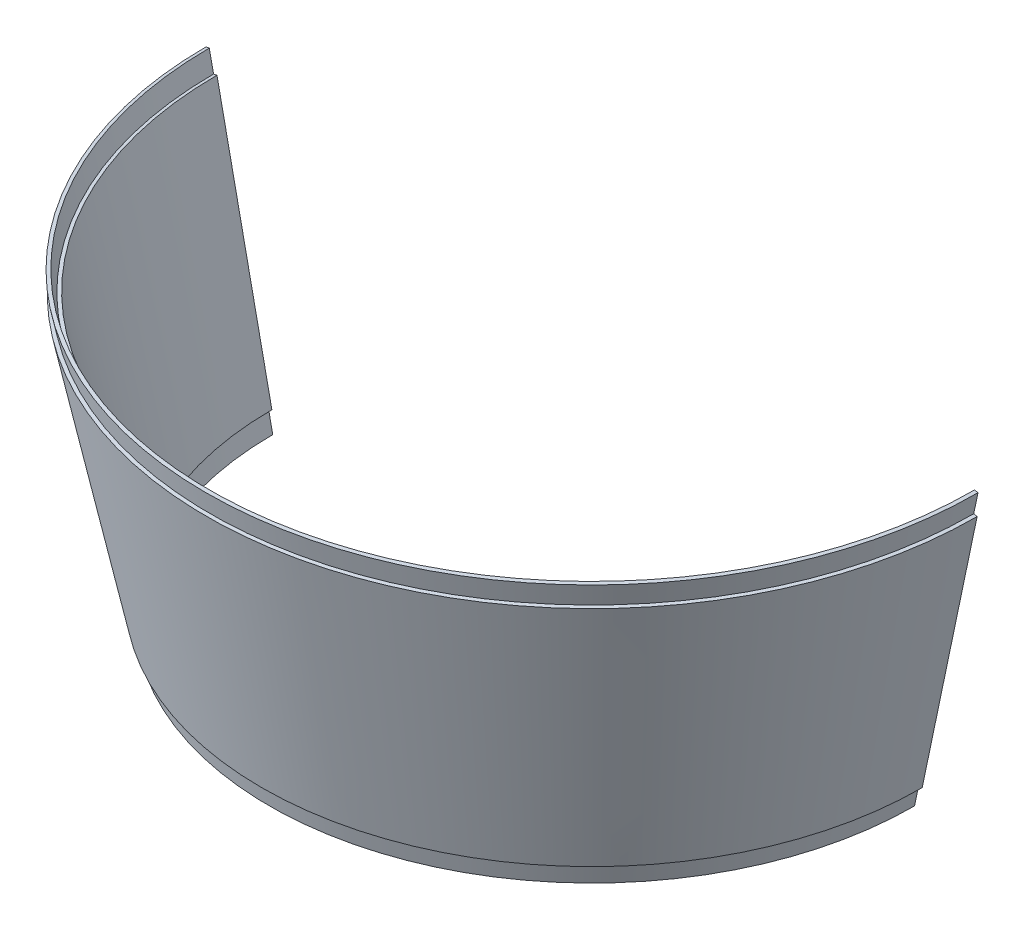
ISO-10303-21;
HEADER;
FILE_DESCRIPTION(('STEP AP214'),'2;1');
FILE_NAME('part.step','',(''),(''),'','','');
FILE_SCHEMA(('AUTOMOTIVE_DESIGN { 1 0 10303 214 1 1 1 1 }'));
ENDSEC;
DATA;
#1=APPLICATION_CONTEXT('core data for automotive mechanical design processes');
#2=APPLICATION_PROTOCOL_DEFINITION('international standard','automotive_design',2000,#1);
#3=PRODUCT_CONTEXT('',#1,'mechanical');
#4=PRODUCT('Part','Part','',(#3));
#5=PRODUCT_RELATED_PRODUCT_CATEGORY('part','',(#4));
#6=PRODUCT_DEFINITION_FORMATION('','',#4);
#7=PRODUCT_DEFINITION_CONTEXT('part definition',#1,'design');
#8=PRODUCT_DEFINITION('design','',#6,#7);
#9=PRODUCT_DEFINITION_SHAPE('','',#8);
#10=(LENGTH_UNIT() NAMED_UNIT(*) SI_UNIT(.MILLI.,.METRE.));
#11=(NAMED_UNIT(*) PLANE_ANGLE_UNIT() SI_UNIT($,.RADIAN.));
#12=(NAMED_UNIT(*) SI_UNIT($,.STERADIAN.) SOLID_ANGLE_UNIT());
#13=UNCERTAINTY_MEASURE_WITH_UNIT(LENGTH_MEASURE(1.E-05),#10,'distance_accuracy_value','');
#14=(GEOMETRIC_REPRESENTATION_CONTEXT(3) GLOBAL_UNCERTAINTY_ASSIGNED_CONTEXT((#13)) GLOBAL_UNIT_ASSIGNED_CONTEXT((#10,
#11,#12)) REPRESENTATION_CONTEXT('',''));
#15=CARTESIAN_POINT('',(0.,0.,0.));
#16=DIRECTION('',(0.,0.,1.));
#17=DIRECTION('',(1.,0.,0.));
#18=AXIS2_PLACEMENT_3D('',#15,#16,#17);
#19=CARTESIAN_POINT('',(0.,0.,0.));
#20=DIRECTION('',(0.,1.,0.));
#21=DIRECTION('',(0.,0.,1.));
#22=AXIS2_PLACEMENT_3D('',#19,#20,#21);
#23=CONICAL_SURFACE('',#22,60.325,0.20647442842569);
#24=DIRECTION('',(0.205010493456532,0.978759775211829,0.));
#25=VECTOR('',#24,1.);
#26=CARTESIAN_POINT('',(0.,-288.003225806452,0.));
#27=LINE('',#26,#25);
#28=CARTESIAN_POINT('',(117.517905405405,273.05,0.));
#29=VERTEX_POINT('',#28);
#30=CARTESIAN_POINT('',(100.755721906632,193.024091683275,0.));
#31=VERTEX_POINT('',#30);
#32=EDGE_CURVE('E235',#29,#31,#27,.F.);
#33=ORIENTED_EDGE('',*,*,#32,.F.);
#34=CARTESIAN_POINT('',(0.,273.05,0.));
#35=DIRECTION('',(0.,-1.,0.));
#36=DIRECTION('',(0.,0.,-1.));
#37=AXIS2_PLACEMENT_3D('',#34,#35,#36);
#38=CIRCLE('',#37,117.517905405405);
#39=CARTESIAN_POINT('',(-117.517905405405,273.05,0.));
#40=VERTEX_POINT('',#39);
#41=EDGE_CURVE('E165',#29,#40,#38,.T.);
#42=ORIENTED_EDGE('',*,*,#41,.T.);
#43=DIRECTION('',(0.205010493456532,-0.978759775211829,0.));
#44=VECTOR('',#43,1.);
#45=CARTESIAN_POINT('',(0.,-288.003225806452,0.));
#46=LINE('',#45,#44);
#47=CARTESIAN_POINT('',(-100.755721906632,193.024091683275,0.));
#48=VERTEX_POINT('',#47);
#49=EDGE_CURVE('E216',#48,#40,#46,.F.);
#50=ORIENTED_EDGE('',*,*,#49,.F.);
#51=CARTESIAN_POINT('',(0.,193.024091683275,0.));
#52=DIRECTION('',(0.,-1.,0.));
#53=DIRECTION('',(0.,0.,-1.));
#54=AXIS2_PLACEMENT_3D('',#51,#52,#53);
#55=CIRCLE('',#54,100.755721906632);
#56=EDGE_CURVE('E167',#31,#48,#55,.T.);
#57=ORIENTED_EDGE('',*,*,#56,.F.);
#58=EDGE_LOOP('',(#33,#42,#50,#57));
#59=FACE_BOUND('',#58,.T.);
#60=ADVANCED_FACE('F42',(#59),#23,.T.);
#61=CARTESIAN_POINT('',(0.,279.699063450411,0.));
#62=DIRECTION('',(0.,1.,0.));
#63=DIRECTION('',(0.,0.,1.));
#64=AXIS2_PLACEMENT_3D('',#61,#62,#63);
#65=CONICAL_SURFACE('',#64,116.748013847989,0.206474428425693);
#66=DIRECTION('',(0.205010493456534,0.978759775211828,0.));
#67=VECTOR('',#66,1.);
#68=CARTESIAN_POINT('',(0.,-277.678551049659,0.));
#69=LINE('',#68,#67);
#70=CARTESIAN_POINT('',(115.44619721454,273.483938877816,0.));
#71=VERTEX_POINT('',#70);
#72=CARTESIAN_POINT('',(116.748013847989,279.699063450411,0.));
#73=VERTEX_POINT('',#72);
#74=EDGE_CURVE('E223',#71,#73,#69,.T.);
#75=ORIENTED_EDGE('',*,*,#74,.F.);
#76=CARTESIAN_POINT('',(0.,273.483938877816,0.));
#77=DIRECTION('',(0.,-1.,0.));
#78=DIRECTION('',(0.,0.,-1.));
#79=AXIS2_PLACEMENT_3D('',#76,#77,#78);
#80=CIRCLE('',#79,115.44619721454);
#81=CARTESIAN_POINT('',(-115.44619721454,273.483938877816,0.));
#82=VERTEX_POINT('',#81);
#83=EDGE_CURVE('E152',#71,#82,#80,.T.);
#84=ORIENTED_EDGE('',*,*,#83,.T.);
#85=DIRECTION('',(0.205010493456534,-0.978759775211828,0.));
#86=VECTOR('',#85,1.);
#87=CARTESIAN_POINT('',(0.,-277.678551049659,0.));
#88=LINE('',#87,#86);
#89=CARTESIAN_POINT('',(-116.748013847989,279.699063450411,0.));
#90=VERTEX_POINT('',#89);
#91=EDGE_CURVE('E258',#90,#82,#88,.T.);
#92=ORIENTED_EDGE('',*,*,#91,.F.);
#93=CARTESIAN_POINT('',(0.,279.699063450411,0.));
#94=DIRECTION('',(0.,-1.,0.));
#95=DIRECTION('',(0.,0.,-1.));
#96=AXIS2_PLACEMENT_3D('',#93,#94,#95);
#97=CIRCLE('',#96,116.748013847989);
#98=EDGE_CURVE('E156',#73,#90,#97,.T.);
#99=ORIENTED_EDGE('',*,*,#98,.F.);
#100=EDGE_LOOP('',(#75,#84,#92,#99));
#101=FACE_BOUND('',#100,.T.);
#102=ADVANCED_FACE('F256',(#101),#65,.F.);
#103=CARTESIAN_POINT('',(0.,273.483938877816,0.));
#104=DIRECTION('',(0.,-1.,0.));
#105=DIRECTION('',(0.,0.,-1.));
#106=AXIS2_PLACEMENT_3D('',#103,#104,#105);
#107=CONICAL_SURFACE('',#106,115.44619721454,1.36432189836932);
#108=DIRECTION('',(-0.978759775211853,-0.205010493456418,0.));
#109=VECTOR('',#108,1.);
#110=CARTESIAN_POINT('',(0.,297.66523694301,0.));
#111=LINE('',#110,#109);
#112=CARTESIAN_POINT('',(-114.410343119108,273.700908316724,0.));
#113=VERTEX_POINT('',#112);
#114=EDGE_CURVE('E57',#82,#113,#111,.F.);
#115=ORIENTED_EDGE('',*,*,#114,.F.);
#116=ORIENTED_EDGE('',*,*,#83,.F.);
#117=DIRECTION('',(-0.978759775211853,0.205010493456418,0.));
#118=VECTOR('',#117,1.);
#119=CARTESIAN_POINT('',(0.,297.66523694301,0.));
#120=LINE('',#119,#118);
#121=CARTESIAN_POINT('',(114.410343119108,273.700908316724,0.));
#122=VERTEX_POINT('',#121);
#123=EDGE_CURVE('E221',#122,#71,#120,.F.);
#124=ORIENTED_EDGE('',*,*,#123,.F.);
#125=CARTESIAN_POINT('',(0.,273.700908316724,0.));
#126=DIRECTION('',(0.,-1.,0.));
#127=DIRECTION('',(0.,0.,-1.));
#128=AXIS2_PLACEMENT_3D('',#125,#126,#127);
#129=CIRCLE('',#128,114.410343119108);
#130=EDGE_CURVE('E150',#122,#113,#129,.T.);
#131=ORIENTED_EDGE('',*,*,#130,.T.);
#132=EDGE_LOOP('',(#115,#116,#124,#131));
#133=FACE_BOUND('',#132,.T.);
#134=ADVANCED_FACE('F262',(#133),#107,.T.);
#135=CARTESIAN_POINT('',(0.,279.482094011503,0.));
#136=DIRECTION('',(0.,-1.,0.));
#137=DIRECTION('',(0.,0.,-1.));
#138=AXIS2_PLACEMENT_3D('',#135,#136,#137);
#139=CONICAL_SURFACE('',#138,117.783867943422,1.36432189836929);
#140=DIRECTION('',(-0.978759775211845,-0.205010493456452,0.));
#141=VECTOR('',#140,1.);
#142=CARTESIAN_POINT('',(0.,304.153039323967,0.));
#143=LINE('',#142,#141);
#144=CARTESIAN_POINT('',(-117.783867943422,279.482094011503,0.));
#145=VERTEX_POINT('',#144);
#146=EDGE_CURVE('E206',#145,#90,#143,.F.);
#147=ORIENTED_EDGE('',*,*,#146,.F.);
#148=CARTESIAN_POINT('',(0.,279.482094011503,0.));
#149=DIRECTION('',(0.,-1.,0.));
#150=DIRECTION('',(0.,0.,-1.));
#151=AXIS2_PLACEMENT_3D('',#148,#149,#150);
#152=CIRCLE('',#151,117.783867943422);
#153=CARTESIAN_POINT('',(117.783867943422,279.482094011503,0.));
#154=VERTEX_POINT('',#153);
#155=EDGE_CURVE('E159',#154,#145,#152,.T.);
#156=ORIENTED_EDGE('',*,*,#155,.F.);
#157=DIRECTION('',(-0.978759775211845,0.205010493456452,0.));
#158=VECTOR('',#157,1.);
#159=CARTESIAN_POINT('',(0.,304.153039323967,0.));
#160=LINE('',#159,#158);
#161=EDGE_CURVE('E226',#73,#154,#160,.F.);
#162=ORIENTED_EDGE('',*,*,#161,.F.);
#163=ORIENTED_EDGE('',*,*,#98,.T.);
#164=EDGE_LOOP('',(#147,#156,#162,#163));
#165=FACE_BOUND('',#164,.T.);
#166=ADVANCED_FACE('F251',(#165),#139,.T.);
#167=CARTESIAN_POINT('',(0.,273.266969438908,0.));
#168=DIRECTION('',(0.,1.,0.));
#169=DIRECTION('',(0.,0.,1.));
#170=AXIS2_PLACEMENT_3D('',#167,#168,#169);
#171=CONICAL_SURFACE('',#170,116.482051309973,0.206474428425692);
#172=DIRECTION('',(0.205010493456533,0.978759775211828,0.));
#173=VECTOR('',#172,1.);
#174=CARTESIAN_POINT('',(0.,-282.840888428054,0.));
#175=LINE('',#174,#173);
#176=CARTESIAN_POINT('',(116.482051309973,273.266969438908,0.));
#177=VERTEX_POINT('',#176);
#178=EDGE_CURVE('E229',#154,#177,#175,.F.);
#179=ORIENTED_EDGE('',*,*,#178,.F.);
#180=ORIENTED_EDGE('',*,*,#155,.T.);
#181=DIRECTION('',(0.205010493456533,-0.978759775211828,0.));
#182=VECTOR('',#181,1.);
#183=CARTESIAN_POINT('',(0.,-282.840888428054,0.));
#184=LINE('',#183,#182);
#185=CARTESIAN_POINT('',(-116.482051309973,273.266969438908,0.));
#186=VERTEX_POINT('',#185);
#187=EDGE_CURVE('E205',#186,#145,#184,.F.);
#188=ORIENTED_EDGE('',*,*,#187,.F.);
#189=CARTESIAN_POINT('',(0.,273.266969438908,0.));
#190=DIRECTION('',(0.,-1.,0.));
#191=DIRECTION('',(0.,0.,-1.));
#192=AXIS2_PLACEMENT_3D('',#189,#190,#191);
#193=CIRCLE('',#192,116.482051309973);
#194=EDGE_CURVE('E162',#177,#186,#193,.T.);
#195=ORIENTED_EDGE('',*,*,#194,.F.);
#196=EDGE_LOOP('',(#179,#180,#188,#195));
#197=FACE_BOUND('',#196,.T.);
#198=ADVANCED_FACE('F246',(#197),#171,.T.);
#199=CARTESIAN_POINT('',(0.,273.05,0.));
#200=DIRECTION('',(0.,-1.,0.));
#201=DIRECTION('',(0.,0.,-1.));
#202=AXIS2_PLACEMENT_3D('',#199,#200,#201);
#203=CONICAL_SURFACE('',#202,117.517905405405,1.36432189836917);
#204=DIRECTION('',(-0.978759775211822,-0.205010493456566,0.));
#205=VECTOR('',#204,1.);
#206=CARTESIAN_POINT('',(0.,297.665236943028,0.));
#207=LINE('',#206,#205);
#208=EDGE_CURVE('E214',#40,#186,#207,.F.);
#209=ORIENTED_EDGE('',*,*,#208,.F.);
#210=ORIENTED_EDGE('',*,*,#41,.F.);
#211=DIRECTION('',(-0.978759775211822,0.205010493456566,0.));
#212=VECTOR('',#211,1.);
#213=CARTESIAN_POINT('',(0.,297.665236943028,0.));
#214=LINE('',#213,#212);
#215=EDGE_CURVE('E234',#177,#29,#214,.F.);
#216=ORIENTED_EDGE('',*,*,#215,.F.);
#217=ORIENTED_EDGE('',*,*,#194,.T.);
#218=EDGE_LOOP('',(#209,#210,#216,#217));
#219=FACE_BOUND('',#218,.T.);
#220=ADVANCED_FACE('F241',(#219),#203,.T.);
#221=CARTESIAN_POINT('',(0.,193.458030561092,0.));
#222=DIRECTION('',(0.,-1.,0.));
#223=DIRECTION('',(0.,0.,-1.));
#224=AXIS2_PLACEMENT_3D('',#221,#222,#223);
#225=CONICAL_SURFACE('',#224,98.6840137157669,1.36432189836924);
#226=CARTESIAN_POINT('',(0.,193.458030561092,0.));
#227=DIRECTION('',(0.,-1.,0.));
#228=DIRECTION('',(0.,0.,-1.));
#229=AXIS2_PLACEMENT_3D('',#226,#227,#228);
#230=CIRCLE('',#229,98.6840137157669);
#231=CARTESIAN_POINT('',(98.6840137157669,193.458030561092,0.));
#232=VERTEX_POINT('',#231);
#233=CARTESIAN_POINT('',(-98.6840137157669,193.458030561092,0.));
#234=VERTEX_POINT('',#233);
#235=EDGE_CURVE('E141',#232,#234,#230,.T.);
#236=ORIENTED_EDGE('',*,*,#235,.T.);
#237=DIRECTION('',(-0.978759775211836,-0.205010493456496,0.));
#238=VECTOR('',#237,1.);
#239=CARTESIAN_POINT('',(0.,214.128330731282,0.));
#240=LINE('',#239,#238);
#241=CARTESIAN_POINT('',(-97.6481596203345,193.675,0.));
#242=VERTEX_POINT('',#241);
#243=EDGE_CURVE('E129',#234,#242,#240,.F.);
#244=ORIENTED_EDGE('',*,*,#243,.T.);
#245=CARTESIAN_POINT('',(0.,193.675,0.));
#246=DIRECTION('',(0.,-1.,0.));
#247=DIRECTION('',(0.,0.,-1.));
#248=AXIS2_PLACEMENT_3D('',#245,#246,#247);
#249=CIRCLE('',#248,97.6481596203344);
#250=CARTESIAN_POINT('',(97.6481596203344,193.675,0.));
#251=VERTEX_POINT('',#250);
#252=EDGE_CURVE('E135',#251,#242,#249,.T.);
#253=ORIENTED_EDGE('',*,*,#252,.F.);
#254=DIRECTION('',(-0.978759775211836,0.205010493456496,0.));
#255=VECTOR('',#254,1.);
#256=CARTESIAN_POINT('',(0.,214.128330731282,0.));
#257=LINE('',#256,#255);
#258=EDGE_CURVE('E65',#251,#232,#257,.F.);
#259=ORIENTED_EDGE('',*,*,#258,.T.);
#260=EDGE_LOOP('',(#236,#244,#253,#259));
#261=FACE_BOUND('',#260,.T.);
#262=ADVANCED_FACE('F139',(#261),#225,.F.);
#263=CARTESIAN_POINT('',(0.,187.242905988497,0.));
#264=DIRECTION('',(0.,1.,0.));
#265=DIRECTION('',(0.,0.,1.));
#266=AXIS2_PLACEMENT_3D('',#263,#264,#265);
#267=CONICAL_SURFACE('',#266,97.382197082318,0.206474428425686);
#268=ORIENTED_EDGE('',*,*,#235,.F.);
#269=DIRECTION('',(0.205010493456527,0.97875977521183,0.));
#270=VECTOR('',#269,1.);
#271=CARTESIAN_POINT('',(0.,-277.678551049676,0.));
#272=LINE('',#271,#270);
#273=CARTESIAN_POINT('',(97.382197082318,187.242905988497,0.));
#274=VERTEX_POINT('',#273);
#275=EDGE_CURVE('E196',#232,#274,#272,.F.);
#276=ORIENTED_EDGE('',*,*,#275,.T.);
#277=CARTESIAN_POINT('',(0.,187.242905988497,0.));
#278=DIRECTION('',(0.,-1.,0.));
#279=DIRECTION('',(0.,0.,-1.));
#280=AXIS2_PLACEMENT_3D('',#277,#278,#279);
#281=CIRCLE('',#280,97.382197082318);
#282=CARTESIAN_POINT('',(-97.382197082318,187.242905988497,0.));
#283=VERTEX_POINT('',#282);
#284=EDGE_CURVE('E146',#274,#283,#281,.T.);
#285=ORIENTED_EDGE('',*,*,#284,.T.);
#286=DIRECTION('',(0.205010493456527,-0.97875977521183,0.));
#287=VECTOR('',#286,1.);
#288=CARTESIAN_POINT('',(0.,-277.678551049676,0.));
#289=LINE('',#288,#287);
#290=EDGE_CURVE('E195',#283,#234,#289,.F.);
#291=ORIENTED_EDGE('',*,*,#290,.T.);
#292=EDGE_LOOP('',(#268,#276,#285,#291));
#293=FACE_BOUND('',#292,.T.);
#294=ADVANCED_FACE('F194',(#293),#267,.F.);
#295=CARTESIAN_POINT('',(0.,187.025936549589,0.));
#296=DIRECTION('',(0.,-1.,0.));
#297=DIRECTION('',(0.,0.,-1.));
#298=AXIS2_PLACEMENT_3D('',#295,#296,#297);
#299=CONICAL_SURFACE('',#298,98.4180511777505,1.36432189836923);
#300=CARTESIAN_POINT('',(0.,187.025936549589,0.));
#301=DIRECTION('',(0.,-1.,0.));
#302=DIRECTION('',(0.,0.,-1.));
#303=AXIS2_PLACEMENT_3D('',#300,#301,#302);
#304=CIRCLE('',#303,98.4180511777505);
#305=CARTESIAN_POINT('',(98.4180511777505,187.025936549589,0.));
#306=VERTEX_POINT('',#305);
#307=CARTESIAN_POINT('',(-98.4180511777505,187.025936549589,0.));
#308=VERTEX_POINT('',#307);
#309=EDGE_CURVE('E183',#306,#308,#304,.T.);
#310=ORIENTED_EDGE('',*,*,#309,.T.);
#311=DIRECTION('',(-0.978759775211834,-0.205010493456508,0.));
#312=VECTOR('',#311,1.);
#313=CARTESIAN_POINT('',(0.,207.640528350331,0.));
#314=LINE('',#313,#312);
#315=EDGE_CURVE('E203',#308,#283,#314,.F.);
#316=ORIENTED_EDGE('',*,*,#315,.T.);
#317=ORIENTED_EDGE('',*,*,#284,.F.);
#318=DIRECTION('',(-0.978759775211834,0.205010493456508,0.));
#319=VECTOR('',#318,1.);
#320=CARTESIAN_POINT('',(0.,207.640528350331,0.));
#321=LINE('',#320,#319);
#322=EDGE_CURVE('E201',#274,#306,#321,.F.);
#323=ORIENTED_EDGE('',*,*,#322,.T.);
#324=EDGE_LOOP('',(#310,#316,#317,#323));
#325=FACE_BOUND('',#324,.T.);
#326=ADVANCED_FACE('F200',(#325),#299,.F.);
#327=CARTESIAN_POINT('',(0.,193.241061122184,0.));
#328=DIRECTION('',(0.,1.,0.));
#329=DIRECTION('',(0.,0.,1.));
#330=AXIS2_PLACEMENT_3D('',#327,#328,#329);
#331=CONICAL_SURFACE('',#330,99.7198678111995,0.20647442842569);
#332=ORIENTED_EDGE('',*,*,#309,.F.);
#333=DIRECTION('',(0.205010493456532,0.978759775211829,0.));
#334=VECTOR('',#333,1.);
#335=CARTESIAN_POINT('',(0.,-282.840888428059,0.));
#336=LINE('',#335,#334);
#337=CARTESIAN_POINT('',(99.7198678111995,193.241061122184,0.));
#338=VERTEX_POINT('',#337);
#339=EDGE_CURVE('E231',#306,#338,#336,.T.);
#340=ORIENTED_EDGE('',*,*,#339,.T.);
#341=CARTESIAN_POINT('',(0.,193.241061122184,0.));
#342=DIRECTION('',(0.,-1.,0.));
#343=DIRECTION('',(0.,0.,-1.));
#344=AXIS2_PLACEMENT_3D('',#341,#342,#343);
#345=CIRCLE('',#344,99.7198678111995);
#346=CARTESIAN_POINT('',(-99.7198678111995,193.241061122184,0.));
#347=VERTEX_POINT('',#346);
#348=EDGE_CURVE('E174',#338,#347,#345,.T.);
#349=ORIENTED_EDGE('',*,*,#348,.T.);
#350=DIRECTION('',(0.205010493456532,-0.978759775211829,0.));
#351=VECTOR('',#350,1.);
#352=CARTESIAN_POINT('',(0.,-282.840888428059,0.));
#353=LINE('',#352,#351);
#354=EDGE_CURVE('E208',#347,#308,#353,.T.);
#355=ORIENTED_EDGE('',*,*,#354,.T.);
#356=EDGE_LOOP('',(#332,#340,#349,#355));
#357=FACE_BOUND('',#356,.T.);
#358=ADVANCED_FACE('F291',(#357),#331,.T.);
#359=CARTESIAN_POINT('',(0.,193.024091683275,0.));
#360=DIRECTION('',(0.,-1.,0.));
#361=DIRECTION('',(0.,0.,-1.));
#362=AXIS2_PLACEMENT_3D('',#359,#360,#361);
#363=CONICAL_SURFACE('',#362,100.755721906632,1.36432189836918);
#364=ORIENTED_EDGE('',*,*,#56,.T.);
#365=DIRECTION('',(-0.978759775211823,-0.20501049345656,0.));
#366=VECTOR('',#365,1.);
#367=CARTESIAN_POINT('',(0.,214.128330731289,0.));
#368=LINE('',#367,#366);
#369=EDGE_CURVE('E218',#48,#347,#368,.F.);
#370=ORIENTED_EDGE('',*,*,#369,.T.);
#371=ORIENTED_EDGE('',*,*,#348,.F.);
#372=DIRECTION('',(-0.978759775211823,0.20501049345656,0.));
#373=VECTOR('',#372,1.);
#374=CARTESIAN_POINT('',(0.,214.128330731289,0.));
#375=LINE('',#374,#373);
#376=EDGE_CURVE('E153',#338,#31,#375,.F.);
#377=ORIENTED_EDGE('',*,*,#376,.T.);
#378=EDGE_LOOP('',(#364,#370,#371,#377));
#379=FACE_BOUND('',#378,.T.);
#380=ADVANCED_FACE('F237',(#379),#363,.F.);
#381=CARTESIAN_POINT('',(0.,-3.175,0.));
#382=DIRECTION('',(0.,1.,0.));
#383=DIRECTION('',(0.,0.,1.));
#384=AXIS2_PLACEMENT_3D('',#381,#382,#383);
#385=CONICAL_SURFACE('',#384,56.4160650257399,0.20647442842569);
#386=ORIENTED_EDGE('',*,*,#130,.F.);
#387=DIRECTION('',(0.205010493456532,0.978759775211829,0.));
#388=VECTOR('',#387,1.);
#389=CARTESIAN_POINT('',(0.,-272.516213671274,0.));
#390=LINE('',#389,#388);
#391=EDGE_CURVE('E11',#122,#251,#390,.F.);
#392=ORIENTED_EDGE('',*,*,#391,.T.);
#393=ORIENTED_EDGE('',*,*,#252,.T.);
#394=DIRECTION('',(0.205010493456532,-0.978759775211829,0.));
#395=VECTOR('',#394,1.);
#396=CARTESIAN_POINT('',(0.,-272.516213671274,0.));
#397=LINE('',#396,#395);
#398=EDGE_CURVE('E50',#242,#113,#397,.F.);
#399=ORIENTED_EDGE('',*,*,#398,.T.);
#400=EDGE_LOOP('',(#386,#392,#393,#399));
#401=FACE_BOUND('',#400,.T.);
#402=ADVANCED_FACE('F44',(#401),#385,.F.);
#403=CARTESIAN_POINT('',(0.,0.,0.));
#404=DIRECTION('',(0.,0.,1.));
#405=DIRECTION('',(1.,0.,0.));
#406=AXIS2_PLACEMENT_3D('',#403,#404,#405);
#407=PLANE('',#406);
#408=ORIENTED_EDGE('',*,*,#49,.T.);
#409=ORIENTED_EDGE('',*,*,#208,.T.);
#410=ORIENTED_EDGE('',*,*,#187,.T.);
#411=ORIENTED_EDGE('',*,*,#146,.T.);
#412=ORIENTED_EDGE('',*,*,#91,.T.);
#413=ORIENTED_EDGE('',*,*,#114,.T.);
#414=ORIENTED_EDGE('',*,*,#398,.F.);
#415=ORIENTED_EDGE('',*,*,#243,.F.);
#416=ORIENTED_EDGE('',*,*,#290,.F.);
#417=ORIENTED_EDGE('',*,*,#315,.F.);
#418=ORIENTED_EDGE('',*,*,#354,.F.);
#419=ORIENTED_EDGE('',*,*,#369,.F.);
#420=EDGE_LOOP('',(#408,#409,#410,#411,#412,#413,#414,#415,#416,#417,#418,#419));
#421=FACE_BOUND('',#420,.T.);
#422=ADVANCED_FACE('F128',(#421),#407,.F.);
#423=ORIENTED_EDGE('',*,*,#339,.F.);
#424=ORIENTED_EDGE('',*,*,#322,.F.);
#425=ORIENTED_EDGE('',*,*,#275,.F.);
#426=ORIENTED_EDGE('',*,*,#258,.F.);
#427=ORIENTED_EDGE('',*,*,#391,.F.);
#428=ORIENTED_EDGE('',*,*,#123,.T.);
#429=ORIENTED_EDGE('',*,*,#74,.T.);
#430=ORIENTED_EDGE('',*,*,#161,.T.);
#431=ORIENTED_EDGE('',*,*,#178,.T.);
#432=ORIENTED_EDGE('',*,*,#215,.T.);
#433=ORIENTED_EDGE('',*,*,#32,.T.);
#434=ORIENTED_EDGE('',*,*,#376,.F.);
#435=EDGE_LOOP('',(#423,#424,#425,#426,#427,#428,#429,#430,#431,#432,#433,#434));
#436=FACE_BOUND('',#435,.T.);
#437=ADVANCED_FACE('F264',(#436),#407,.F.);
#438=CLOSED_SHELL('',(#60,#102,#134,#166,#198,#220,#262,#294,#326,#358,#380,#402,#422,#437));
#439=MANIFOLD_SOLID_BREP('B2',#438);
#440=ADVANCED_BREP_SHAPE_REPRESENTATION('',(#18,#439),#14);
#441=SHAPE_DEFINITION_REPRESENTATION(#9,#440);
ENDSEC;
END-ISO-10303-21;
